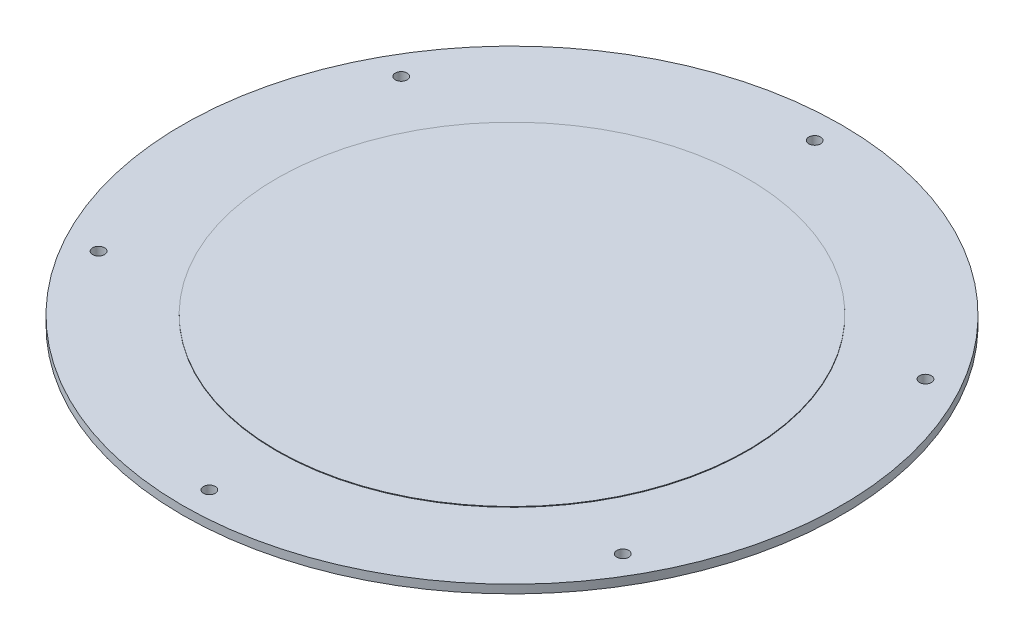
ISO-10303-21;
HEADER;
FILE_DESCRIPTION(('STEP AP214'),'2;1');
FILE_NAME('part.step','',(''),(''),'','','');
FILE_SCHEMA(('AUTOMOTIVE_DESIGN { 1 0 10303 214 1 1 1 1 }'));
ENDSEC;
DATA;
#1=APPLICATION_CONTEXT('core data for automotive mechanical design processes');
#2=APPLICATION_PROTOCOL_DEFINITION('international standard','automotive_design',2000,#1);
#3=PRODUCT_CONTEXT('',#1,'mechanical');
#4=PRODUCT('Part','Part','',(#3));
#5=PRODUCT_RELATED_PRODUCT_CATEGORY('part','',(#4));
#6=PRODUCT_DEFINITION_FORMATION('','',#4);
#7=PRODUCT_DEFINITION_CONTEXT('part definition',#1,'design');
#8=PRODUCT_DEFINITION('design','',#6,#7);
#9=PRODUCT_DEFINITION_SHAPE('','',#8);
#10=(LENGTH_UNIT() NAMED_UNIT(*) SI_UNIT(.MILLI.,.METRE.));
#11=(NAMED_UNIT(*) PLANE_ANGLE_UNIT() SI_UNIT($,.RADIAN.));
#12=(NAMED_UNIT(*) SI_UNIT($,.STERADIAN.) SOLID_ANGLE_UNIT());
#13=UNCERTAINTY_MEASURE_WITH_UNIT(LENGTH_MEASURE(1.E-05),#10,'distance_accuracy_value','');
#14=(GEOMETRIC_REPRESENTATION_CONTEXT(3) GLOBAL_UNCERTAINTY_ASSIGNED_CONTEXT((#13)) GLOBAL_UNIT_ASSIGNED_CONTEXT((#10,
#11,#12)) REPRESENTATION_CONTEXT('',''));
#15=CARTESIAN_POINT('',(0.,0.,0.));
#16=DIRECTION('',(0.,0.,1.));
#17=DIRECTION('',(1.,0.,0.));
#18=AXIS2_PLACEMENT_3D('',#15,#16,#17);
#19=CARTESIAN_POINT('',(0.,0.,0.));
#20=DIRECTION('',(0.,1.,0.));
#21=DIRECTION('',(0.,0.,1.));
#22=AXIS2_PLACEMENT_3D('',#19,#20,#21);
#23=CYLINDRICAL_SURFACE('',#22,88.9);
#24=CARTESIAN_POINT('',(0.,9.525,0.));
#25=DIRECTION('',(0.,-1.,0.));
#26=DIRECTION('',(0.,0.,-1.));
#27=AXIS2_PLACEMENT_3D('',#24,#25,#26);
#28=CIRCLE('',#27,88.9);
#29=CARTESIAN_POINT('',(0.,9.525,-88.9));
#30=VERTEX_POINT('',#29);
#31=EDGE_CURVE('E98',#30,#30,#28,.T.);
#32=ORIENTED_EDGE('',*,*,#31,.T.);
#33=EDGE_LOOP('',(#32));
#34=FACE_BOUND('',#33,.T.);
#35=CARTESIAN_POINT('',(0.,10.414,0.));
#36=DIRECTION('',(0.,1.,0.));
#37=DIRECTION('',(0.,0.,1.));
#38=AXIS2_PLACEMENT_3D('',#35,#36,#37);
#39=CIRCLE('',#38,88.9);
#40=CARTESIAN_POINT('',(0.,10.414,88.9));
#41=VERTEX_POINT('',#40);
#42=EDGE_CURVE('E10',#41,#41,#39,.F.);
#43=ORIENTED_EDGE('',*,*,#42,.F.);
#44=EDGE_LOOP('',(#43));
#45=FACE_BOUND('',#44,.T.);
#46=ADVANCED_FACE('F33',(#34,#45),#23,.F.);
#47=CARTESIAN_POINT('',(0.,0.,0.));
#48=DIRECTION('',(0.,-1.,0.));
#49=DIRECTION('',(0.,0.,-1.));
#50=AXIS2_PLACEMENT_3D('',#47,#48,#49);
#51=CYLINDRICAL_SURFACE('',#50,92.71);
#52=CARTESIAN_POINT('',(0.,9.52500000000001,0.));
#53=DIRECTION('',(0.,-1.,0.));
#54=DIRECTION('',(0.,0.,-1.));
#55=AXIS2_PLACEMENT_3D('',#52,#53,#54);
#56=CIRCLE('',#55,92.71);
#57=CARTESIAN_POINT('',(0.,9.52500000000001,-92.71));
#58=VERTEX_POINT('',#57);
#59=EDGE_CURVE('E59',#58,#58,#56,.T.);
#60=ORIENTED_EDGE('',*,*,#59,.T.);
#61=EDGE_LOOP('',(#60));
#62=FACE_BOUND('',#61,.T.);
#63=CARTESIAN_POINT('',(0.,0.,0.));
#64=DIRECTION('',(0.,-1.,0.));
#65=DIRECTION('',(0.,0.,-1.));
#66=AXIS2_PLACEMENT_3D('',#63,#64,#65);
#67=CIRCLE('',#66,92.71);
#68=CARTESIAN_POINT('',(0.,0.,-92.71));
#69=VERTEX_POINT('',#68);
#70=EDGE_CURVE('E40',#69,#69,#67,.T.);
#71=ORIENTED_EDGE('',*,*,#70,.F.);
#72=EDGE_LOOP('',(#71));
#73=FACE_BOUND('',#72,.T.);
#74=ADVANCED_FACE('F35',(#62,#73),#51,.T.);
#75=CARTESIAN_POINT('',(0.,0.,-89.535));
#76=DIRECTION('',(0.,-1.,0.));
#77=DIRECTION('',(0.,0.,-1.));
#78=AXIS2_PLACEMENT_3D('',#75,#76,#77);
#79=PLANE('',#78);
#80=ORIENTED_EDGE('',*,*,#70,.T.);
#81=EDGE_LOOP('',(#80));
#82=FACE_BOUND('',#81,.T.);
#83=CARTESIAN_POINT('',(0.,0.,0.));
#84=DIRECTION('',(0.,-1.,0.));
#85=DIRECTION('',(0.,0.,-1.));
#86=AXIS2_PLACEMENT_3D('',#83,#84,#85);
#87=CIRCLE('',#86,89.535);
#88=CARTESIAN_POINT('',(0.,0.,-89.535));
#89=VERTEX_POINT('',#88);
#90=EDGE_CURVE('E44',#89,#89,#87,.T.);
#91=ORIENTED_EDGE('',*,*,#90,.F.);
#92=EDGE_LOOP('',(#91));
#93=FACE_BOUND('',#92,.T.);
#94=ADVANCED_FACE('F128',(#82,#93),#79,.T.);
#95=CARTESIAN_POINT('',(0.,0.,0.));
#96=DIRECTION('',(0.,-1.,0.));
#97=DIRECTION('',(0.,0.,-1.));
#98=AXIS2_PLACEMENT_3D('',#95,#96,#97);
#99=CYLINDRICAL_SURFACE('',#98,89.535);
#100=ORIENTED_EDGE('',*,*,#90,.T.);
#101=EDGE_LOOP('',(#100));
#102=FACE_BOUND('',#101,.T.);
#103=CARTESIAN_POINT('',(0.,9.52500000000001,0.));
#104=DIRECTION('',(0.,-1.,0.));
#105=DIRECTION('',(0.,0.,-1.));
#106=AXIS2_PLACEMENT_3D('',#103,#104,#105);
#107=CIRCLE('',#106,89.535);
#108=CARTESIAN_POINT('',(0.,9.52500000000001,-89.535));
#109=VERTEX_POINT('',#108);
#110=EDGE_CURVE('E48',#109,#109,#107,.T.);
#111=ORIENTED_EDGE('',*,*,#110,.F.);
#112=EDGE_LOOP('',(#111));
#113=FACE_BOUND('',#112,.T.);
#114=ADVANCED_FACE('F170',(#102,#113),#99,.F.);
#115=CARTESIAN_POINT('',(0.,9.525,0.));
#116=DIRECTION('',(0.,-1.,0.));
#117=DIRECTION('',(0.,0.,-1.));
#118=AXIS2_PLACEMENT_3D('',#115,#116,#117);
#119=PLANE('',#118);
#120=ORIENTED_EDGE('',*,*,#31,.F.);
#121=EDGE_LOOP('',(#120));
#122=FACE_BOUND('',#121,.T.);
#123=ORIENTED_EDGE('',*,*,#110,.T.);
#124=EDGE_LOOP('',(#123));
#125=FACE_BOUND('',#124,.T.);
#126=ADVANCED_FACE('F166',(#122,#125),#119,.T.);
#127=CARTESIAN_POINT('',(0.,12.7,-124.46));
#128=DIRECTION('',(0.,1.,0.));
#129=DIRECTION('',(0.,0.,1.));
#130=AXIS2_PLACEMENT_3D('',#127,#128,#129);
#131=PLANE('',#130);
#132=CARTESIAN_POINT('',(0.,12.7,0.));
#133=DIRECTION('',(0.,1.,0.));
#134=DIRECTION('',(0.,0.,1.));
#135=AXIS2_PLACEMENT_3D('',#132,#133,#134);
#136=CIRCLE('',#135,88.9);
#137=CARTESIAN_POINT('',(0.,12.7,88.9));
#138=VERTEX_POINT('',#137);
#139=EDGE_CURVE('E101',#138,#138,#136,.T.);
#140=ORIENTED_EDGE('',*,*,#139,.F.);
#141=EDGE_LOOP('',(#140));
#142=FACE_BOUND('',#141,.T.);
#143=CARTESIAN_POINT('',(-98.9867036525606,12.7,-57.1500000000011));
#144=DIRECTION('',(0.,1.,0.));
#145=DIRECTION('',(0.,0.,1.));
#146=AXIS2_PLACEMENT_3D('',#143,#144,#145);
#147=CIRCLE('',#146,2.2479);
#148=CARTESIAN_POINT('',(-98.9867036525606,12.7,-54.9021000000011));
#149=VERTEX_POINT('',#148);
#150=EDGE_CURVE('E95',#149,#149,#147,.T.);
#151=ORIENTED_EDGE('',*,*,#150,.F.);
#152=EDGE_LOOP('',(#151));
#153=FACE_BOUND('',#152,.T.);
#154=CARTESIAN_POINT('',(-98.9867036525618,12.7,57.149999999999));
#155=DIRECTION('',(0.,1.,0.));
#156=DIRECTION('',(0.,0.,1.));
#157=AXIS2_PLACEMENT_3D('',#154,#155,#156);
#158=CIRCLE('',#157,2.2479);
#159=CARTESIAN_POINT('',(-98.9867036525618,12.7,59.397899999999));
#160=VERTEX_POINT('',#159);
#161=EDGE_CURVE('E89',#160,#160,#158,.T.);
#162=ORIENTED_EDGE('',*,*,#161,.F.);
#163=EDGE_LOOP('',(#162));
#164=FACE_BOUND('',#163,.T.);
#165=CARTESIAN_POINT('',(0.,12.7,114.3));
#166=DIRECTION('',(0.,1.,0.));
#167=DIRECTION('',(0.,0.,1.));
#168=AXIS2_PLACEMENT_3D('',#165,#166,#167);
#169=CIRCLE('',#168,2.2479);
#170=CARTESIAN_POINT('',(0.,12.7,116.5479));
#171=VERTEX_POINT('',#170);
#172=EDGE_CURVE('E83',#171,#171,#169,.T.);
#173=ORIENTED_EDGE('',*,*,#172,.F.);
#174=EDGE_LOOP('',(#173));
#175=FACE_BOUND('',#174,.T.);
#176=CARTESIAN_POINT('',(98.986703652561,12.7,57.1500000000004));
#177=DIRECTION('',(0.,1.,0.));
#178=DIRECTION('',(0.,0.,1.));
#179=AXIS2_PLACEMENT_3D('',#176,#177,#178);
#180=CIRCLE('',#179,2.2479);
#181=CARTESIAN_POINT('',(98.986703652561,12.7,59.3979000000004));
#182=VERTEX_POINT('',#181);
#183=EDGE_CURVE('E77',#182,#182,#180,.T.);
#184=ORIENTED_EDGE('',*,*,#183,.F.);
#185=EDGE_LOOP('',(#184));
#186=FACE_BOUND('',#185,.T.);
#187=CARTESIAN_POINT('',(98.9867036525614,12.7,-57.1499999999997));
#188=DIRECTION('',(0.,1.,0.));
#189=DIRECTION('',(0.,0.,1.));
#190=AXIS2_PLACEMENT_3D('',#187,#188,#189);
#191=CIRCLE('',#190,2.2479);
#192=CARTESIAN_POINT('',(98.9867036525614,12.7,-54.9020999999997));
#193=VERTEX_POINT('',#192);
#194=EDGE_CURVE('E71',#193,#193,#191,.T.);
#195=ORIENTED_EDGE('',*,*,#194,.F.);
#196=EDGE_LOOP('',(#195));
#197=FACE_BOUND('',#196,.T.);
#198=CARTESIAN_POINT('',(0.,12.7,-114.3));
#199=DIRECTION('',(0.,1.,0.));
#200=DIRECTION('',(0.,0.,1.));
#201=AXIS2_PLACEMENT_3D('',#198,#199,#200);
#202=CIRCLE('',#201,2.2479);
#203=CARTESIAN_POINT('',(0.,12.7,-112.0521));
#204=VERTEX_POINT('',#203);
#205=EDGE_CURVE('E65',#204,#204,#202,.T.);
#206=ORIENTED_EDGE('',*,*,#205,.F.);
#207=EDGE_LOOP('',(#206));
#208=FACE_BOUND('',#207,.T.);
#209=CARTESIAN_POINT('',(0.,12.7,0.));
#210=DIRECTION('',(0.,-1.,0.));
#211=DIRECTION('',(0.,0.,-1.));
#212=AXIS2_PLACEMENT_3D('',#209,#210,#211);
#213=CIRCLE('',#212,124.46);
#214=CARTESIAN_POINT('',(0.,12.7,-124.46));
#215=VERTEX_POINT('',#214);
#216=EDGE_CURVE('E53',#215,#215,#213,.T.);
#217=ORIENTED_EDGE('',*,*,#216,.F.);
#218=EDGE_LOOP('',(#217));
#219=FACE_BOUND('',#218,.T.);
#220=ADVANCED_FACE('F162',(#142,#153,#164,#175,#186,#197,#208,#219),#131,.T.);
#221=CARTESIAN_POINT('',(0.,0.,0.));
#222=DIRECTION('',(0.,-1.,0.));
#223=DIRECTION('',(0.,0.,-1.));
#224=AXIS2_PLACEMENT_3D('',#221,#222,#223);
#225=CYLINDRICAL_SURFACE('',#224,124.46);
#226=ORIENTED_EDGE('',*,*,#216,.T.);
#227=EDGE_LOOP('',(#226));
#228=FACE_BOUND('',#227,.T.);
#229=CARTESIAN_POINT('',(0.,9.52500000000001,0.));
#230=DIRECTION('',(0.,-1.,0.));
#231=DIRECTION('',(0.,0.,-1.));
#232=AXIS2_PLACEMENT_3D('',#229,#230,#231);
#233=CIRCLE('',#232,124.46);
#234=CARTESIAN_POINT('',(0.,9.525,-124.46));
#235=VERTEX_POINT('',#234);
#236=EDGE_CURVE('E56',#235,#235,#233,.T.);
#237=ORIENTED_EDGE('',*,*,#236,.F.);
#238=EDGE_LOOP('',(#237));
#239=FACE_BOUND('',#238,.T.);
#240=ADVANCED_FACE('F158',(#228,#239),#225,.T.);
#241=CARTESIAN_POINT('',(0.,9.52500000000001,-92.71));
#242=DIRECTION('',(0.,-1.,0.));
#243=DIRECTION('',(0.,0.,-1.));
#244=AXIS2_PLACEMENT_3D('',#241,#242,#243);
#245=PLANE('',#244);
#246=CARTESIAN_POINT('',(-98.9867036525606,9.52500000000001,-57.1500000000011));
#247=DIRECTION('',(0.,-1.,0.));
#248=DIRECTION('',(0.,0.,-1.));
#249=AXIS2_PLACEMENT_3D('',#246,#247,#248);
#250=CIRCLE('',#249,2.2479);
#251=CARTESIAN_POINT('',(-98.9867036525606,9.52500000000001,-59.3979000000011));
#252=VERTEX_POINT('',#251);
#253=EDGE_CURVE('E92',#252,#252,#250,.T.);
#254=ORIENTED_EDGE('',*,*,#253,.F.);
#255=EDGE_LOOP('',(#254));
#256=FACE_BOUND('',#255,.T.);
#257=CARTESIAN_POINT('',(-98.9867036525618,9.52500000000001,57.149999999999));
#258=DIRECTION('',(0.,-1.,0.));
#259=DIRECTION('',(0.,0.,-1.));
#260=AXIS2_PLACEMENT_3D('',#257,#258,#259);
#261=CIRCLE('',#260,2.2479);
#262=CARTESIAN_POINT('',(-98.9867036525618,9.52500000000001,54.902099999999));
#263=VERTEX_POINT('',#262);
#264=EDGE_CURVE('E86',#263,#263,#261,.T.);
#265=ORIENTED_EDGE('',*,*,#264,.F.);
#266=EDGE_LOOP('',(#265));
#267=FACE_BOUND('',#266,.T.);
#268=CARTESIAN_POINT('',(0.,9.52500000000001,114.3));
#269=DIRECTION('',(0.,-1.,0.));
#270=DIRECTION('',(0.,0.,-1.));
#271=AXIS2_PLACEMENT_3D('',#268,#269,#270);
#272=CIRCLE('',#271,2.2479);
#273=CARTESIAN_POINT('',(0.,9.52500000000001,112.0521));
#274=VERTEX_POINT('',#273);
#275=EDGE_CURVE('E80',#274,#274,#272,.T.);
#276=ORIENTED_EDGE('',*,*,#275,.F.);
#277=EDGE_LOOP('',(#276));
#278=FACE_BOUND('',#277,.T.);
#279=CARTESIAN_POINT('',(98.986703652561,9.52500000000001,57.1500000000004));
#280=DIRECTION('',(0.,-1.,0.));
#281=DIRECTION('',(0.,0.,-1.));
#282=AXIS2_PLACEMENT_3D('',#279,#280,#281);
#283=CIRCLE('',#282,2.2479);
#284=CARTESIAN_POINT('',(98.986703652561,9.52500000000001,54.9021000000004));
#285=VERTEX_POINT('',#284);
#286=EDGE_CURVE('E74',#285,#285,#283,.T.);
#287=ORIENTED_EDGE('',*,*,#286,.F.);
#288=EDGE_LOOP('',(#287));
#289=FACE_BOUND('',#288,.T.);
#290=CARTESIAN_POINT('',(98.9867036525614,9.52500000000001,-57.1499999999997));
#291=DIRECTION('',(0.,-1.,0.));
#292=DIRECTION('',(0.,0.,-1.));
#293=AXIS2_PLACEMENT_3D('',#290,#291,#292);
#294=CIRCLE('',#293,2.2479);
#295=CARTESIAN_POINT('',(98.9867036525614,9.52500000000001,-59.3978999999997));
#296=VERTEX_POINT('',#295);
#297=EDGE_CURVE('E68',#296,#296,#294,.T.);
#298=ORIENTED_EDGE('',*,*,#297,.F.);
#299=EDGE_LOOP('',(#298));
#300=FACE_BOUND('',#299,.T.);
#301=CARTESIAN_POINT('',(0.,9.52500000000001,-114.3));
#302=DIRECTION('',(0.,-1.,0.));
#303=DIRECTION('',(0.,0.,-1.));
#304=AXIS2_PLACEMENT_3D('',#301,#302,#303);
#305=CIRCLE('',#304,2.2479);
#306=CARTESIAN_POINT('',(0.,9.52500000000001,-116.5479));
#307=VERTEX_POINT('',#306);
#308=EDGE_CURVE('E62',#307,#307,#305,.T.);
#309=ORIENTED_EDGE('',*,*,#308,.F.);
#310=EDGE_LOOP('',(#309));
#311=FACE_BOUND('',#310,.T.);
#312=ORIENTED_EDGE('',*,*,#236,.T.);
#313=EDGE_LOOP('',(#312));
#314=FACE_BOUND('',#313,.T.);
#315=ORIENTED_EDGE('',*,*,#59,.F.);
#316=EDGE_LOOP('',(#315));
#317=FACE_BOUND('',#316,.T.);
#318=ADVANCED_FACE('F154',(#256,#267,#278,#289,#300,#311,#314,#317),#245,.T.);
#319=CARTESIAN_POINT('',(0.,12.7,-114.3));
#320=DIRECTION('',(0.,1.,0.));
#321=DIRECTION('',(0.,0.,1.));
#322=AXIS2_PLACEMENT_3D('',#319,#320,#321);
#323=CYLINDRICAL_SURFACE('',#322,2.2479);
#324=ORIENTED_EDGE('',*,*,#205,.T.);
#325=EDGE_LOOP('',(#324));
#326=FACE_BOUND('',#325,.T.);
#327=ORIENTED_EDGE('',*,*,#308,.T.);
#328=EDGE_LOOP('',(#327));
#329=FACE_BOUND('',#328,.T.);
#330=ADVANCED_FACE('F150',(#326,#329),#323,.F.);
#331=CARTESIAN_POINT('',(98.9867036525614,12.7,-57.1499999999997));
#332=DIRECTION('',(0.,1.,0.));
#333=DIRECTION('',(0.,0.,1.));
#334=AXIS2_PLACEMENT_3D('',#331,#332,#333);
#335=CYLINDRICAL_SURFACE('',#334,2.2479);
#336=ORIENTED_EDGE('',*,*,#194,.T.);
#337=EDGE_LOOP('',(#336));
#338=FACE_BOUND('',#337,.T.);
#339=ORIENTED_EDGE('',*,*,#297,.T.);
#340=EDGE_LOOP('',(#339));
#341=FACE_BOUND('',#340,.T.);
#342=ADVANCED_FACE('F146',(#338,#341),#335,.F.);
#343=CARTESIAN_POINT('',(98.986703652561,12.7,57.1500000000004));
#344=DIRECTION('',(0.,1.,0.));
#345=DIRECTION('',(0.,0.,1.));
#346=AXIS2_PLACEMENT_3D('',#343,#344,#345);
#347=CYLINDRICAL_SURFACE('',#346,2.2479);
#348=ORIENTED_EDGE('',*,*,#183,.T.);
#349=EDGE_LOOP('',(#348));
#350=FACE_BOUND('',#349,.T.);
#351=ORIENTED_EDGE('',*,*,#286,.T.);
#352=EDGE_LOOP('',(#351));
#353=FACE_BOUND('',#352,.T.);
#354=ADVANCED_FACE('F142',(#350,#353),#347,.F.);
#355=CARTESIAN_POINT('',(0.,12.7,114.3));
#356=DIRECTION('',(0.,1.,0.));
#357=DIRECTION('',(0.,0.,1.));
#358=AXIS2_PLACEMENT_3D('',#355,#356,#357);
#359=CYLINDRICAL_SURFACE('',#358,2.2479);
#360=ORIENTED_EDGE('',*,*,#172,.T.);
#361=EDGE_LOOP('',(#360));
#362=FACE_BOUND('',#361,.T.);
#363=ORIENTED_EDGE('',*,*,#275,.T.);
#364=EDGE_LOOP('',(#363));
#365=FACE_BOUND('',#364,.T.);
#366=ADVANCED_FACE('F138',(#362,#365),#359,.F.);
#367=CARTESIAN_POINT('',(-98.9867036525618,12.7,57.149999999999));
#368=DIRECTION('',(0.,1.,0.));
#369=DIRECTION('',(0.,0.,1.));
#370=AXIS2_PLACEMENT_3D('',#367,#368,#369);
#371=CYLINDRICAL_SURFACE('',#370,2.2479);
#372=ORIENTED_EDGE('',*,*,#161,.T.);
#373=EDGE_LOOP('',(#372));
#374=FACE_BOUND('',#373,.T.);
#375=ORIENTED_EDGE('',*,*,#264,.T.);
#376=EDGE_LOOP('',(#375));
#377=FACE_BOUND('',#376,.T.);
#378=ADVANCED_FACE('F134',(#374,#377),#371,.F.);
#379=CARTESIAN_POINT('',(-98.9867036525606,12.7,-57.1500000000011));
#380=DIRECTION('',(0.,1.,0.));
#381=DIRECTION('',(0.,0.,1.));
#382=AXIS2_PLACEMENT_3D('',#379,#380,#381);
#383=CYLINDRICAL_SURFACE('',#382,2.2479);
#384=ORIENTED_EDGE('',*,*,#150,.T.);
#385=EDGE_LOOP('',(#384));
#386=FACE_BOUND('',#385,.T.);
#387=ORIENTED_EDGE('',*,*,#253,.T.);
#388=EDGE_LOOP('',(#387));
#389=FACE_BOUND('',#388,.T.);
#390=ADVANCED_FACE('F120',(#386,#389),#383,.F.);
#391=CARTESIAN_POINT('',(0.,10.414,0.));
#392=DIRECTION('',(0.,1.,0.));
#393=DIRECTION('',(0.,0.,1.));
#394=AXIS2_PLACEMENT_3D('',#391,#392,#393);
#395=PLANE('',#394);
#396=ORIENTED_EDGE('',*,*,#42,.T.);
#397=EDGE_LOOP('',(#396));
#398=FACE_BOUND('',#397,.T.);
#399=ADVANCED_FACE('F112',(#398),#395,.F.);
#400=CARTESIAN_POINT('',(0.,10.414,0.));
#401=DIRECTION('',(0.,1.,0.));
#402=DIRECTION('',(0.,0.,1.));
#403=AXIS2_PLACEMENT_3D('',#400,#401,#402);
#404=CYLINDRICAL_SURFACE('',#403,88.9);
#405=ORIENTED_EDGE('',*,*,#139,.T.);
#406=EDGE_LOOP('',(#405));
#407=FACE_BOUND('',#406,.T.);
#408=CARTESIAN_POINT('',(0.,12.954,0.));
#409=DIRECTION('',(0.,1.,0.));
#410=DIRECTION('',(0.,0.,1.));
#411=AXIS2_PLACEMENT_3D('',#408,#409,#410);
#412=CIRCLE('',#411,88.9);
#413=CARTESIAN_POINT('',(0.,12.954,88.9));
#414=VERTEX_POINT('',#413);
#415=EDGE_CURVE('E104',#414,#414,#412,.T.);
#416=ORIENTED_EDGE('',*,*,#415,.F.);
#417=EDGE_LOOP('',(#416));
#418=FACE_BOUND('',#417,.T.);
#419=ADVANCED_FACE('F110',(#407,#418),#404,.T.);
#420=CARTESIAN_POINT('',(0.,12.954,0.));
#421=DIRECTION('',(0.,1.,0.));
#422=DIRECTION('',(0.,0.,1.));
#423=AXIS2_PLACEMENT_3D('',#420,#421,#422);
#424=PLANE('',#423);
#425=ORIENTED_EDGE('',*,*,#415,.T.);
#426=EDGE_LOOP('',(#425));
#427=FACE_BOUND('',#426,.T.);
#428=ADVANCED_FACE('F108',(#427),#424,.T.);
#429=CLOSED_SHELL('',(#46,#74,#94,#114,#126,#220,#240,#318,#330,#342,#354,#366,#378,#390,#399,
#419,#428));
#430=MANIFOLD_SOLID_BREP('B2',#429);
#431=ADVANCED_BREP_SHAPE_REPRESENTATION('',(#18,#430),#14);
#432=SHAPE_DEFINITION_REPRESENTATION(#9,#431);
ENDSEC;
END-ISO-10303-21;
